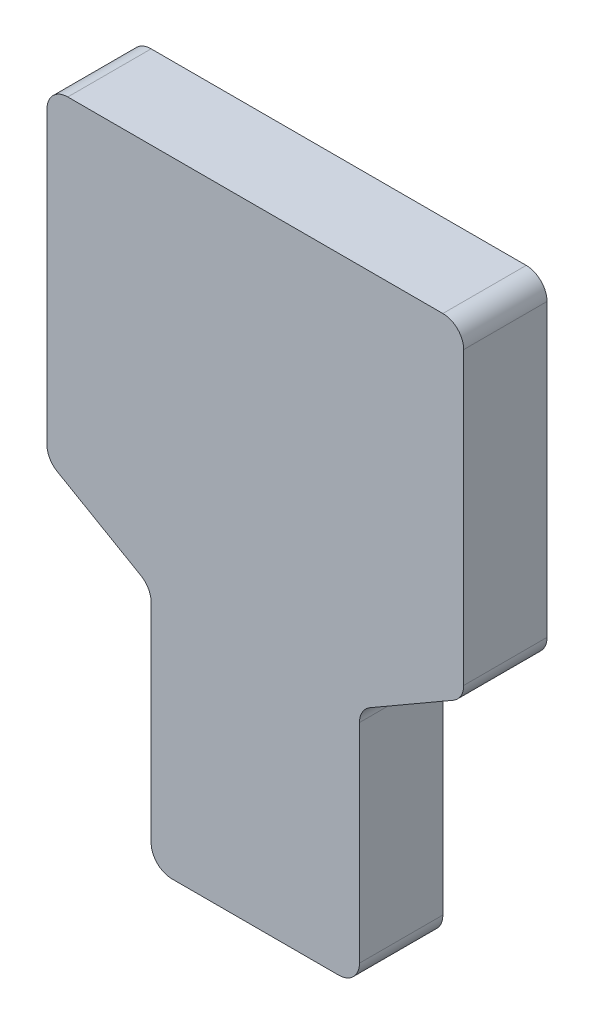
ISO-10303-21;
HEADER;
FILE_DESCRIPTION(('STEP AP214'),'2;1');
FILE_NAME('part.step','',(''),(''),'','','');
FILE_SCHEMA(('AUTOMOTIVE_DESIGN { 1 0 10303 214 1 1 1 1 }'));
ENDSEC;
DATA;
#1=APPLICATION_CONTEXT('core data for automotive mechanical design processes');
#2=APPLICATION_PROTOCOL_DEFINITION('international standard','automotive_design',2000,#1);
#3=PRODUCT_CONTEXT('',#1,'mechanical');
#4=PRODUCT('Part','Part','',(#3));
#5=PRODUCT_RELATED_PRODUCT_CATEGORY('part','',(#4));
#6=PRODUCT_DEFINITION_FORMATION('','',#4);
#7=PRODUCT_DEFINITION_CONTEXT('part definition',#1,'design');
#8=PRODUCT_DEFINITION('design','',#6,#7);
#9=PRODUCT_DEFINITION_SHAPE('','',#8);
#10=(LENGTH_UNIT() NAMED_UNIT(*) SI_UNIT(.MILLI.,.METRE.));
#11=(NAMED_UNIT(*) PLANE_ANGLE_UNIT() SI_UNIT($,.RADIAN.));
#12=(NAMED_UNIT(*) SI_UNIT($,.STERADIAN.) SOLID_ANGLE_UNIT());
#13=UNCERTAINTY_MEASURE_WITH_UNIT(LENGTH_MEASURE(1.E-05),#10,'distance_accuracy_value','');
#14=(GEOMETRIC_REPRESENTATION_CONTEXT(3) GLOBAL_UNCERTAINTY_ASSIGNED_CONTEXT((#13)) GLOBAL_UNIT_ASSIGNED_CONTEXT((#10,
#11,#12)) REPRESENTATION_CONTEXT('',''));
#15=CARTESIAN_POINT('',(0.,0.,0.));
#16=DIRECTION('',(0.,0.,1.));
#17=DIRECTION('',(1.,0.,0.));
#18=AXIS2_PLACEMENT_3D('',#15,#16,#17);
#19=CARTESIAN_POINT('',(-90.,290.,20.));
#20=DIRECTION('',(0.,0.,-1.));
#21=DIRECTION('',(-1.,0.,0.));
#22=AXIS2_PLACEMENT_3D('',#19,#20,#21);
#23=CYLINDRICAL_SURFACE('',#22,10.);
#24=CARTESIAN_POINT('',(-90.,290.,-20.));
#25=DIRECTION('',(0.,0.,1.));
#26=DIRECTION('',(-1.,0.,0.));
#27=AXIS2_PLACEMENT_3D('',#24,#25,#26);
#28=CIRCLE('',#27,10.);
#29=CARTESIAN_POINT('',(-90.,300.,-20.));
#30=VERTEX_POINT('',#29);
#31=CARTESIAN_POINT('',(-100.,290.,-20.));
#32=VERTEX_POINT('',#31);
#33=EDGE_CURVE('E176',#30,#32,#28,.T.);
#34=ORIENTED_EDGE('',*,*,#33,.T.);
#35=DIRECTION('',(0.,0.,-1.));
#36=VECTOR('',#35,1.);
#37=CARTESIAN_POINT('',(-100.,290.,20.));
#38=LINE('',#37,#36);
#39=CARTESIAN_POINT('',(-100.,290.,20.));
#40=VERTEX_POINT('',#39);
#41=EDGE_CURVE('E11',#40,#32,#38,.T.);
#42=ORIENTED_EDGE('',*,*,#41,.F.);
#43=CARTESIAN_POINT('',(-90.,290.,20.));
#44=DIRECTION('',(0.,0.,1.));
#45=DIRECTION('',(-1.,0.,0.));
#46=AXIS2_PLACEMENT_3D('',#43,#44,#45);
#47=CIRCLE('',#46,10.);
#48=CARTESIAN_POINT('',(-90.,300.,20.));
#49=VERTEX_POINT('',#48);
#50=EDGE_CURVE('E206',#49,#40,#47,.T.);
#51=ORIENTED_EDGE('',*,*,#50,.F.);
#52=DIRECTION('',(0.,0.,-1.));
#53=VECTOR('',#52,1.);
#54=CARTESIAN_POINT('',(-90.,300.,20.));
#55=LINE('',#54,#53);
#56=EDGE_CURVE('E172',#49,#30,#55,.T.);
#57=ORIENTED_EDGE('',*,*,#56,.T.);
#58=EDGE_LOOP('',(#34,#42,#51,#57));
#59=FACE_BOUND('',#58,.T.);
#60=ADVANCED_FACE('F32',(#59),#23,.T.);
#61=CARTESIAN_POINT('',(-100.,150.414518843274,20.));
#62=DIRECTION('',(1.,0.,0.));
#63=DIRECTION('',(0.,1.,0.));
#64=AXIS2_PLACEMENT_3D('',#61,#62,#63);
#65=PLANE('',#64);
#66=DIRECTION('',(0.,-1.,0.));
#67=VECTOR('',#66,1.);
#68=CARTESIAN_POINT('',(-100.,150.414518843274,-20.));
#69=LINE('',#68,#67);
#70=CARTESIAN_POINT('',(-100.,150.414518843274,-20.));
#71=VERTEX_POINT('',#70);
#72=EDGE_CURVE('E179',#32,#71,#69,.T.);
#73=ORIENTED_EDGE('',*,*,#72,.T.);
#74=DIRECTION('',(0.,0.,-1.));
#75=VECTOR('',#74,1.);
#76=CARTESIAN_POINT('',(-100.,150.414518843274,20.));
#77=LINE('',#76,#75);
#78=CARTESIAN_POINT('',(-100.,150.414518843274,20.));
#79=VERTEX_POINT('',#78);
#80=EDGE_CURVE('E40',#79,#71,#77,.T.);
#81=ORIENTED_EDGE('',*,*,#80,.F.);
#82=DIRECTION('',(0.,-1.,0.));
#83=VECTOR('',#82,1.);
#84=CARTESIAN_POINT('',(-100.,150.414518843274,20.));
#85=LINE('',#84,#83);
#86=EDGE_CURVE('E115',#40,#79,#85,.T.);
#87=ORIENTED_EDGE('',*,*,#86,.F.);
#88=ORIENTED_EDGE('',*,*,#41,.T.);
#89=EDGE_LOOP('',(#73,#81,#87,#88));
#90=FACE_BOUND('',#89,.T.);
#91=ADVANCED_FACE('F304',(#90),#65,.F.);
#92=CARTESIAN_POINT('',(-90.,150.414518843274,20.));
#93=DIRECTION('',(0.,0.,-1.));
#94=DIRECTION('',(-1.,0.,0.));
#95=AXIS2_PLACEMENT_3D('',#92,#93,#94);
#96=CYLINDRICAL_SURFACE('',#95,10.);
#97=CARTESIAN_POINT('',(-90.,150.414518843274,-20.));
#98=DIRECTION('',(0.,0.,1.));
#99=DIRECTION('',(-1.,0.,0.));
#100=AXIS2_PLACEMENT_3D('',#97,#98,#99);
#101=CIRCLE('',#100,10.);
#102=CARTESIAN_POINT('',(-95.,141.754264805429,-20.));
#103=VERTEX_POINT('',#102);
#104=EDGE_CURVE('E181',#71,#103,#101,.T.);
#105=ORIENTED_EDGE('',*,*,#104,.T.);
#106=DIRECTION('',(0.,0.,-1.));
#107=VECTOR('',#106,1.);
#108=CARTESIAN_POINT('',(-95.,141.754264805429,20.));
#109=LINE('',#108,#107);
#110=CARTESIAN_POINT('',(-95.,141.754264805429,20.));
#111=VERTEX_POINT('',#110);
#112=EDGE_CURVE('E237',#111,#103,#109,.T.);
#113=ORIENTED_EDGE('',*,*,#112,.F.);
#114=CARTESIAN_POINT('',(-90.,150.414518843274,20.));
#115=DIRECTION('',(0.,0.,1.));
#116=DIRECTION('',(-1.,0.,0.));
#117=AXIS2_PLACEMENT_3D('',#114,#115,#116);
#118=CIRCLE('',#117,10.);
#119=EDGE_CURVE('E245',#79,#111,#118,.T.);
#120=ORIENTED_EDGE('',*,*,#119,.F.);
#121=ORIENTED_EDGE('',*,*,#80,.T.);
#122=EDGE_LOOP('',(#105,#113,#120,#121));
#123=FACE_BOUND('',#122,.T.);
#124=ADVANCED_FACE('F243',(#123),#96,.T.);
#125=CARTESIAN_POINT('',(-55.,118.660254037844,20.));
#126=DIRECTION('',(0.499999999999997,0.86602540378444,0.));
#127=DIRECTION('',(-0.86602540378444,0.499999999999997,0.));
#128=AXIS2_PLACEMENT_3D('',#125,#126,#127);
#129=PLANE('',#128);
#130=DIRECTION('',(0.86602540378444,-0.499999999999997,0.));
#131=VECTOR('',#130,1.);
#132=CARTESIAN_POINT('',(-55.,118.660254037844,-20.));
#133=LINE('',#132,#131);
#134=CARTESIAN_POINT('',(-55.,118.660254037844,-20.));
#135=VERTEX_POINT('',#134);
#136=EDGE_CURVE('E183',#103,#135,#133,.T.);
#137=ORIENTED_EDGE('',*,*,#136,.T.);
#138=DIRECTION('',(0.,0.,-1.));
#139=VECTOR('',#138,1.);
#140=CARTESIAN_POINT('',(-55.,118.660254037844,20.));
#141=LINE('',#140,#139);
#142=CARTESIAN_POINT('',(-55.,118.660254037844,20.));
#143=VERTEX_POINT('',#142);
#144=EDGE_CURVE('E234',#143,#135,#141,.T.);
#145=ORIENTED_EDGE('',*,*,#144,.F.);
#146=DIRECTION('',(0.86602540378444,-0.499999999999997,0.));
#147=VECTOR('',#146,1.);
#148=CARTESIAN_POINT('',(-55.,118.660254037844,20.));
#149=LINE('',#148,#147);
#150=EDGE_CURVE('E263',#111,#143,#149,.T.);
#151=ORIENTED_EDGE('',*,*,#150,.F.);
#152=ORIENTED_EDGE('',*,*,#112,.T.);
#153=EDGE_LOOP('',(#137,#145,#151,#152));
#154=FACE_BOUND('',#153,.T.);
#155=ADVANCED_FACE('F254',(#154),#129,.F.);
#156=CARTESIAN_POINT('',(-60.,110.,20.));
#157=DIRECTION('',(0.,0.,-1.));
#158=DIRECTION('',(-1.,0.,0.));
#159=AXIS2_PLACEMENT_3D('',#156,#157,#158);
#160=CYLINDRICAL_SURFACE('',#159,10.);
#161=CARTESIAN_POINT('',(-60.,110.,-20.));
#162=DIRECTION('',(0.,0.,-1.));
#163=DIRECTION('',(1.,0.,0.));
#164=AXIS2_PLACEMENT_3D('',#161,#162,#163);
#165=CIRCLE('',#164,10.);
#166=CARTESIAN_POINT('',(-50.,110.,-20.));
#167=VERTEX_POINT('',#166);
#168=EDGE_CURVE('E185',#135,#167,#165,.T.);
#169=ORIENTED_EDGE('',*,*,#168,.T.);
#170=DIRECTION('',(0.,0.,-1.));
#171=VECTOR('',#170,1.);
#172=CARTESIAN_POINT('',(-50.,110.,20.));
#173=LINE('',#172,#171);
#174=CARTESIAN_POINT('',(-50.,110.,20.));
#175=VERTEX_POINT('',#174);
#176=EDGE_CURVE('E231',#175,#167,#173,.T.);
#177=ORIENTED_EDGE('',*,*,#176,.F.);
#178=CARTESIAN_POINT('',(-60.,110.,20.));
#179=DIRECTION('',(0.,0.,-1.));
#180=DIRECTION('',(1.,0.,0.));
#181=AXIS2_PLACEMENT_3D('',#178,#179,#180);
#182=CIRCLE('',#181,10.);
#183=EDGE_CURVE('E260',#143,#175,#182,.T.);
#184=ORIENTED_EDGE('',*,*,#183,.F.);
#185=ORIENTED_EDGE('',*,*,#144,.T.);
#186=EDGE_LOOP('',(#169,#177,#184,#185));
#187=FACE_BOUND('',#186,.T.);
#188=ADVANCED_FACE('F258',(#187),#160,.F.);
#189=CARTESIAN_POINT('',(-50.,10.,20.));
#190=DIRECTION('',(1.,0.,0.));
#191=DIRECTION('',(0.,0.,-1.));
#192=AXIS2_PLACEMENT_3D('',#189,#190,#191);
#193=PLANE('',#192);
#194=DIRECTION('',(0.,-1.,0.));
#195=VECTOR('',#194,1.);
#196=CARTESIAN_POINT('',(-50.,10.,-20.));
#197=LINE('',#196,#195);
#198=CARTESIAN_POINT('',(-50.,10.,-20.));
#199=VERTEX_POINT('',#198);
#200=EDGE_CURVE('E187',#167,#199,#197,.T.);
#201=ORIENTED_EDGE('',*,*,#200,.T.);
#202=DIRECTION('',(0.,0.,-1.));
#203=VECTOR('',#202,1.);
#204=CARTESIAN_POINT('',(-50.,10.,20.));
#205=LINE('',#204,#203);
#206=CARTESIAN_POINT('',(-50.,10.,20.));
#207=VERTEX_POINT('',#206);
#208=EDGE_CURVE('E228',#207,#199,#205,.T.);
#209=ORIENTED_EDGE('',*,*,#208,.F.);
#210=DIRECTION('',(0.,-1.,0.));
#211=VECTOR('',#210,1.);
#212=CARTESIAN_POINT('',(-50.,10.,20.));
#213=LINE('',#212,#211);
#214=EDGE_CURVE('E262',#175,#207,#213,.T.);
#215=ORIENTED_EDGE('',*,*,#214,.F.);
#216=ORIENTED_EDGE('',*,*,#176,.T.);
#217=EDGE_LOOP('',(#201,#209,#215,#216));
#218=FACE_BOUND('',#217,.T.);
#219=ADVANCED_FACE('F317',(#218),#193,.F.);
#220=CARTESIAN_POINT('',(-40.,10.,20.));
#221=DIRECTION('',(0.,0.,-1.));
#222=DIRECTION('',(-1.,0.,0.));
#223=AXIS2_PLACEMENT_3D('',#220,#221,#222);
#224=CYLINDRICAL_SURFACE('',#223,10.);
#225=CARTESIAN_POINT('',(-40.,10.,-20.));
#226=DIRECTION('',(0.,0.,1.));
#227=DIRECTION('',(-1.,0.,0.));
#228=AXIS2_PLACEMENT_3D('',#225,#226,#227);
#229=CIRCLE('',#228,10.);
#230=CARTESIAN_POINT('',(-40.,0.,-20.));
#231=VERTEX_POINT('',#230);
#232=EDGE_CURVE('E189',#199,#231,#229,.T.);
#233=ORIENTED_EDGE('',*,*,#232,.T.);
#234=DIRECTION('',(0.,0.,-1.));
#235=VECTOR('',#234,1.);
#236=CARTESIAN_POINT('',(-40.,0.,20.));
#237=LINE('',#236,#235);
#238=CARTESIAN_POINT('',(-40.,0.,20.));
#239=VERTEX_POINT('',#238);
#240=EDGE_CURVE('E225',#239,#231,#237,.T.);
#241=ORIENTED_EDGE('',*,*,#240,.F.);
#242=CARTESIAN_POINT('',(-40.,10.,20.));
#243=DIRECTION('',(0.,0.,1.));
#244=DIRECTION('',(-1.,0.,0.));
#245=AXIS2_PLACEMENT_3D('',#242,#243,#244);
#246=CIRCLE('',#245,10.);
#247=EDGE_CURVE('E265',#207,#239,#246,.T.);
#248=ORIENTED_EDGE('',*,*,#247,.F.);
#249=ORIENTED_EDGE('',*,*,#208,.T.);
#250=EDGE_LOOP('',(#233,#241,#248,#249));
#251=FACE_BOUND('',#250,.T.);
#252=ADVANCED_FACE('F320',(#251),#224,.T.);
#253=CARTESIAN_POINT('',(-40.,0.,20.));
#254=DIRECTION('',(0.,1.,0.));
#255=DIRECTION('',(-1.,0.,0.));
#256=AXIS2_PLACEMENT_3D('',#253,#254,#255);
#257=PLANE('',#256);
#258=DIRECTION('',(1.,0.,0.));
#259=VECTOR('',#258,1.);
#260=CARTESIAN_POINT('',(-40.,0.,-20.));
#261=LINE('',#260,#259);
#262=CARTESIAN_POINT('',(40.,0.,-20.));
#263=VERTEX_POINT('',#262);
#264=EDGE_CURVE('E191',#231,#263,#261,.T.);
#265=ORIENTED_EDGE('',*,*,#264,.T.);
#266=DIRECTION('',(0.,0.,-1.));
#267=VECTOR('',#266,1.);
#268=CARTESIAN_POINT('',(40.,0.,20.));
#269=LINE('',#268,#267);
#270=CARTESIAN_POINT('',(40.,0.,20.));
#271=VERTEX_POINT('',#270);
#272=EDGE_CURVE('E222',#271,#263,#269,.T.);
#273=ORIENTED_EDGE('',*,*,#272,.F.);
#274=DIRECTION('',(1.,0.,0.));
#275=VECTOR('',#274,1.);
#276=CARTESIAN_POINT('',(-40.,0.,20.));
#277=LINE('',#276,#275);
#278=EDGE_CURVE('E271',#239,#271,#277,.T.);
#279=ORIENTED_EDGE('',*,*,#278,.F.);
#280=ORIENTED_EDGE('',*,*,#240,.T.);
#281=EDGE_LOOP('',(#265,#273,#279,#280));
#282=FACE_BOUND('',#281,.T.);
#283=ADVANCED_FACE('F324',(#282),#257,.F.);
#284=CARTESIAN_POINT('',(40.,10.,20.));
#285=DIRECTION('',(0.,0.,-1.));
#286=DIRECTION('',(-1.,0.,0.));
#287=AXIS2_PLACEMENT_3D('',#284,#285,#286);
#288=CYLINDRICAL_SURFACE('',#287,10.);
#289=CARTESIAN_POINT('',(40.,10.,-20.));
#290=DIRECTION('',(0.,0.,1.));
#291=DIRECTION('',(1.,0.,0.));
#292=AXIS2_PLACEMENT_3D('',#289,#290,#291);
#293=CIRCLE('',#292,10.);
#294=CARTESIAN_POINT('',(50.,10.,-20.));
#295=VERTEX_POINT('',#294);
#296=EDGE_CURVE('E193',#263,#295,#293,.T.);
#297=ORIENTED_EDGE('',*,*,#296,.T.);
#298=DIRECTION('',(0.,0.,-1.));
#299=VECTOR('',#298,1.);
#300=CARTESIAN_POINT('',(50.,10.,20.));
#301=LINE('',#300,#299);
#302=CARTESIAN_POINT('',(50.,10.,20.));
#303=VERTEX_POINT('',#302);
#304=EDGE_CURVE('E219',#303,#295,#301,.T.);
#305=ORIENTED_EDGE('',*,*,#304,.F.);
#306=CARTESIAN_POINT('',(40.,10.,20.));
#307=DIRECTION('',(0.,0.,1.));
#308=DIRECTION('',(1.,0.,0.));
#309=AXIS2_PLACEMENT_3D('',#306,#307,#308);
#310=CIRCLE('',#309,10.);
#311=EDGE_CURVE('E273',#271,#303,#310,.T.);
#312=ORIENTED_EDGE('',*,*,#311,.F.);
#313=ORIENTED_EDGE('',*,*,#272,.T.);
#314=EDGE_LOOP('',(#297,#305,#312,#313));
#315=FACE_BOUND('',#314,.T.);
#316=ADVANCED_FACE('F328',(#315),#288,.T.);
#317=CARTESIAN_POINT('',(50.,10.,20.));
#318=DIRECTION('',(-1.,0.,0.));
#319=DIRECTION('',(0.,-1.,0.));
#320=AXIS2_PLACEMENT_3D('',#317,#318,#319);
#321=PLANE('',#320);
#322=DIRECTION('',(0.,1.,0.));
#323=VECTOR('',#322,1.);
#324=CARTESIAN_POINT('',(50.,10.,-20.));
#325=LINE('',#324,#323);
#326=CARTESIAN_POINT('',(50.,110.,-20.));
#327=VERTEX_POINT('',#326);
#328=EDGE_CURVE('E195',#295,#327,#325,.T.);
#329=ORIENTED_EDGE('',*,*,#328,.T.);
#330=DIRECTION('',(0.,0.,-1.));
#331=VECTOR('',#330,1.);
#332=CARTESIAN_POINT('',(50.,110.,20.));
#333=LINE('',#332,#331);
#334=CARTESIAN_POINT('',(50.,110.,20.));
#335=VERTEX_POINT('',#334);
#336=EDGE_CURVE('E216',#335,#327,#333,.T.);
#337=ORIENTED_EDGE('',*,*,#336,.F.);
#338=DIRECTION('',(0.,1.,0.));
#339=VECTOR('',#338,1.);
#340=CARTESIAN_POINT('',(50.,10.,20.));
#341=LINE('',#340,#339);
#342=EDGE_CURVE('E275',#303,#335,#341,.T.);
#343=ORIENTED_EDGE('',*,*,#342,.F.);
#344=ORIENTED_EDGE('',*,*,#304,.T.);
#345=EDGE_LOOP('',(#329,#337,#343,#344));
#346=FACE_BOUND('',#345,.T.);
#347=ADVANCED_FACE('F332',(#346),#321,.F.);
#348=CARTESIAN_POINT('',(60.,110.,20.));
#349=DIRECTION('',(0.,0.,-1.));
#350=DIRECTION('',(-1.,0.,0.));
#351=AXIS2_PLACEMENT_3D('',#348,#349,#350);
#352=CYLINDRICAL_SURFACE('',#351,10.);
#353=CARTESIAN_POINT('',(60.,110.,-20.));
#354=DIRECTION('',(0.,0.,-1.));
#355=DIRECTION('',(-1.,0.,0.));
#356=AXIS2_PLACEMENT_3D('',#353,#354,#355);
#357=CIRCLE('',#356,10.);
#358=CARTESIAN_POINT('',(55.,118.660254037844,-20.));
#359=VERTEX_POINT('',#358);
#360=EDGE_CURVE('E197',#327,#359,#357,.T.);
#361=ORIENTED_EDGE('',*,*,#360,.T.);
#362=DIRECTION('',(0.,0.,-1.));
#363=VECTOR('',#362,1.);
#364=CARTESIAN_POINT('',(55.,118.660254037844,20.));
#365=LINE('',#364,#363);
#366=CARTESIAN_POINT('',(55.,118.660254037844,20.));
#367=VERTEX_POINT('',#366);
#368=EDGE_CURVE('E213',#367,#359,#365,.T.);
#369=ORIENTED_EDGE('',*,*,#368,.F.);
#370=CARTESIAN_POINT('',(60.,110.,20.));
#371=DIRECTION('',(0.,0.,-1.));
#372=DIRECTION('',(-1.,0.,0.));
#373=AXIS2_PLACEMENT_3D('',#370,#371,#372);
#374=CIRCLE('',#373,10.);
#375=EDGE_CURVE('E277',#335,#367,#374,.T.);
#376=ORIENTED_EDGE('',*,*,#375,.F.);
#377=ORIENTED_EDGE('',*,*,#336,.T.);
#378=EDGE_LOOP('',(#361,#369,#376,#377));
#379=FACE_BOUND('',#378,.T.);
#380=ADVANCED_FACE('F336',(#379),#352,.F.);
#381=CARTESIAN_POINT('',(55.,118.660254037844,20.));
#382=DIRECTION('',(-0.499999999999999,0.866025403784439,0.));
#383=DIRECTION('',(-0.866025403784439,-0.499999999999999,0.));
#384=AXIS2_PLACEMENT_3D('',#381,#382,#383);
#385=PLANE('',#384);
#386=DIRECTION('',(0.866025403784439,0.499999999999999,0.));
#387=VECTOR('',#386,1.);
#388=CARTESIAN_POINT('',(55.,118.660254037844,-20.));
#389=LINE('',#388,#387);
#390=CARTESIAN_POINT('',(95.,141.754264805429,-20.));
#391=VERTEX_POINT('',#390);
#392=EDGE_CURVE('E199',#359,#391,#389,.T.);
#393=ORIENTED_EDGE('',*,*,#392,.T.);
#394=DIRECTION('',(0.,0.,-1.));
#395=VECTOR('',#394,1.);
#396=CARTESIAN_POINT('',(95.,141.754264805429,20.));
#397=LINE('',#396,#395);
#398=CARTESIAN_POINT('',(95.,141.754264805429,20.));
#399=VERTEX_POINT('',#398);
#400=EDGE_CURVE('E210',#399,#391,#397,.T.);
#401=ORIENTED_EDGE('',*,*,#400,.F.);
#402=DIRECTION('',(0.866025403784439,0.499999999999999,0.));
#403=VECTOR('',#402,1.);
#404=CARTESIAN_POINT('',(55.,118.660254037844,20.));
#405=LINE('',#404,#403);
#406=EDGE_CURVE('E279',#367,#399,#405,.T.);
#407=ORIENTED_EDGE('',*,*,#406,.F.);
#408=ORIENTED_EDGE('',*,*,#368,.T.);
#409=EDGE_LOOP('',(#393,#401,#407,#408));
#410=FACE_BOUND('',#409,.T.);
#411=ADVANCED_FACE('F285',(#410),#385,.F.);
#412=CARTESIAN_POINT('',(90.,150.414518843274,20.));
#413=DIRECTION('',(0.,0.,-1.));
#414=DIRECTION('',(-1.,0.,0.));
#415=AXIS2_PLACEMENT_3D('',#412,#413,#414);
#416=CYLINDRICAL_SURFACE('',#415,9.99999999999999);
#417=CARTESIAN_POINT('',(90.,150.414518843274,-20.));
#418=DIRECTION('',(0.,0.,1.));
#419=DIRECTION('',(1.,0.,0.));
#420=AXIS2_PLACEMENT_3D('',#417,#418,#419);
#421=CIRCLE('',#420,9.99999999999999);
#422=CARTESIAN_POINT('',(100.,150.414518843274,-20.));
#423=VERTEX_POINT('',#422);
#424=EDGE_CURVE('E201',#391,#423,#421,.T.);
#425=ORIENTED_EDGE('',*,*,#424,.T.);
#426=DIRECTION('',(0.,0.,-1.));
#427=VECTOR('',#426,1.);
#428=CARTESIAN_POINT('',(100.,150.414518843274,20.));
#429=LINE('',#428,#427);
#430=CARTESIAN_POINT('',(100.,150.414518843274,20.));
#431=VERTEX_POINT('',#430);
#432=EDGE_CURVE('E167',#431,#423,#429,.T.);
#433=ORIENTED_EDGE('',*,*,#432,.F.);
#434=CARTESIAN_POINT('',(90.,150.414518843274,20.));
#435=DIRECTION('',(0.,0.,1.));
#436=DIRECTION('',(1.,0.,0.));
#437=AXIS2_PLACEMENT_3D('',#434,#435,#436);
#438=CIRCLE('',#437,9.99999999999999);
#439=EDGE_CURVE('E158',#399,#431,#438,.T.);
#440=ORIENTED_EDGE('',*,*,#439,.F.);
#441=ORIENTED_EDGE('',*,*,#400,.T.);
#442=EDGE_LOOP('',(#425,#433,#440,#441));
#443=FACE_BOUND('',#442,.T.);
#444=ADVANCED_FACE('F289',(#443),#416,.T.);
#445=CARTESIAN_POINT('',(100.,150.414518843274,20.));
#446=DIRECTION('',(-1.,0.,0.));
#447=DIRECTION('',(0.,-1.,0.));
#448=AXIS2_PLACEMENT_3D('',#445,#446,#447);
#449=PLANE('',#448);
#450=DIRECTION('',(0.,1.,0.));
#451=VECTOR('',#450,1.);
#452=CARTESIAN_POINT('',(100.,150.414518843274,-20.));
#453=LINE('',#452,#451);
#454=CARTESIAN_POINT('',(100.,290.,-20.));
#455=VERTEX_POINT('',#454);
#456=EDGE_CURVE('E166',#423,#455,#453,.T.);
#457=ORIENTED_EDGE('',*,*,#456,.T.);
#458=DIRECTION('',(0.,0.,-1.));
#459=VECTOR('',#458,1.);
#460=CARTESIAN_POINT('',(100.,290.,20.));
#461=LINE('',#460,#459);
#462=CARTESIAN_POINT('',(100.,290.,20.));
#463=VERTEX_POINT('',#462);
#464=EDGE_CURVE('E163',#463,#455,#461,.T.);
#465=ORIENTED_EDGE('',*,*,#464,.F.);
#466=DIRECTION('',(0.,1.,0.));
#467=VECTOR('',#466,1.);
#468=CARTESIAN_POINT('',(100.,150.414518843274,20.));
#469=LINE('',#468,#467);
#470=EDGE_CURVE('E152',#431,#463,#469,.T.);
#471=ORIENTED_EDGE('',*,*,#470,.F.);
#472=ORIENTED_EDGE('',*,*,#432,.T.);
#473=EDGE_LOOP('',(#457,#465,#471,#472));
#474=FACE_BOUND('',#473,.T.);
#475=ADVANCED_FACE('F164',(#474),#449,.F.);
#476=CARTESIAN_POINT('',(90.,290.,20.));
#477=DIRECTION('',(0.,0.,-1.));
#478=DIRECTION('',(-1.,0.,0.));
#479=AXIS2_PLACEMENT_3D('',#476,#477,#478);
#480=CYLINDRICAL_SURFACE('',#479,10.);
#481=CARTESIAN_POINT('',(90.,290.,-20.));
#482=DIRECTION('',(0.,0.,1.));
#483=DIRECTION('',(1.,0.,0.));
#484=AXIS2_PLACEMENT_3D('',#481,#482,#483);
#485=CIRCLE('',#484,10.);
#486=CARTESIAN_POINT('',(90.,300.,-20.));
#487=VERTEX_POINT('',#486);
#488=EDGE_CURVE('E101',#455,#487,#485,.T.);
#489=ORIENTED_EDGE('',*,*,#488,.T.);
#490=DIRECTION('',(0.,0.,-1.));
#491=VECTOR('',#490,1.);
#492=CARTESIAN_POINT('',(90.,300.,20.));
#493=LINE('',#492,#491);
#494=CARTESIAN_POINT('',(90.,300.,20.));
#495=VERTEX_POINT('',#494);
#496=EDGE_CURVE('E168',#495,#487,#493,.T.);
#497=ORIENTED_EDGE('',*,*,#496,.F.);
#498=CARTESIAN_POINT('',(90.,290.,20.));
#499=DIRECTION('',(0.,0.,1.));
#500=DIRECTION('',(1.,0.,0.));
#501=AXIS2_PLACEMENT_3D('',#498,#499,#500);
#502=CIRCLE('',#501,10.);
#503=EDGE_CURVE('E156',#463,#495,#502,.T.);
#504=ORIENTED_EDGE('',*,*,#503,.F.);
#505=ORIENTED_EDGE('',*,*,#464,.T.);
#506=EDGE_LOOP('',(#489,#497,#504,#505));
#507=FACE_BOUND('',#506,.T.);
#508=ADVANCED_FACE('F170',(#507),#480,.T.);
#509=CARTESIAN_POINT('',(-90.,300.,20.));
#510=DIRECTION('',(0.,-1.,0.));
#511=DIRECTION('',(0.,0.,-1.));
#512=AXIS2_PLACEMENT_3D('',#509,#510,#511);
#513=PLANE('',#512);
#514=DIRECTION('',(-1.,0.,0.));
#515=VECTOR('',#514,1.);
#516=CARTESIAN_POINT('',(-90.,300.,-20.));
#517=LINE('',#516,#515);
#518=EDGE_CURVE('E107',#487,#30,#517,.T.);
#519=ORIENTED_EDGE('',*,*,#518,.T.);
#520=ORIENTED_EDGE('',*,*,#56,.F.);
#521=DIRECTION('',(-1.,0.,0.));
#522=VECTOR('',#521,1.);
#523=CARTESIAN_POINT('',(-90.,300.,20.));
#524=LINE('',#523,#522);
#525=EDGE_CURVE('E48',#495,#49,#524,.T.);
#526=ORIENTED_EDGE('',*,*,#525,.F.);
#527=ORIENTED_EDGE('',*,*,#496,.T.);
#528=EDGE_LOOP('',(#519,#520,#526,#527));
#529=FACE_BOUND('',#528,.T.);
#530=ADVANCED_FACE('F293',(#529),#513,.F.);
#531=CARTESIAN_POINT('',(-90.,290.,20.));
#532=DIRECTION('',(0.,0.,-1.));
#533=DIRECTION('',(-1.,0.,0.));
#534=AXIS2_PLACEMENT_3D('',#531,#532,#533);
#535=PLANE('',#534);
#536=ORIENTED_EDGE('',*,*,#50,.T.);
#537=ORIENTED_EDGE('',*,*,#86,.T.);
#538=ORIENTED_EDGE('',*,*,#119,.T.);
#539=ORIENTED_EDGE('',*,*,#150,.T.);
#540=ORIENTED_EDGE('',*,*,#183,.T.);
#541=ORIENTED_EDGE('',*,*,#214,.T.);
#542=ORIENTED_EDGE('',*,*,#247,.T.);
#543=ORIENTED_EDGE('',*,*,#278,.T.);
#544=ORIENTED_EDGE('',*,*,#311,.T.);
#545=ORIENTED_EDGE('',*,*,#342,.T.);
#546=ORIENTED_EDGE('',*,*,#375,.T.);
#547=ORIENTED_EDGE('',*,*,#406,.T.);
#548=ORIENTED_EDGE('',*,*,#439,.T.);
#549=ORIENTED_EDGE('',*,*,#470,.T.);
#550=ORIENTED_EDGE('',*,*,#503,.T.);
#551=ORIENTED_EDGE('',*,*,#525,.T.);
#552=EDGE_LOOP('',(#536,#537,#538,#539,#540,#541,#542,#543,#544,#545,#546,#547,#548,#549,#550,#551));
#553=FACE_BOUND('',#552,.T.);
#554=ADVANCED_FACE('F154',(#553),#535,.F.);
#555=CARTESIAN_POINT('',(-90.,290.,-20.));
#556=DIRECTION('',(0.,0.,-1.));
#557=DIRECTION('',(-1.,0.,0.));
#558=AXIS2_PLACEMENT_3D('',#555,#556,#557);
#559=PLANE('',#558);
#560=ORIENTED_EDGE('',*,*,#33,.F.);
#561=ORIENTED_EDGE('',*,*,#518,.F.);
#562=ORIENTED_EDGE('',*,*,#488,.F.);
#563=ORIENTED_EDGE('',*,*,#456,.F.);
#564=ORIENTED_EDGE('',*,*,#424,.F.);
#565=ORIENTED_EDGE('',*,*,#392,.F.);
#566=ORIENTED_EDGE('',*,*,#360,.F.);
#567=ORIENTED_EDGE('',*,*,#328,.F.);
#568=ORIENTED_EDGE('',*,*,#296,.F.);
#569=ORIENTED_EDGE('',*,*,#264,.F.);
#570=ORIENTED_EDGE('',*,*,#232,.F.);
#571=ORIENTED_EDGE('',*,*,#200,.F.);
#572=ORIENTED_EDGE('',*,*,#168,.F.);
#573=ORIENTED_EDGE('',*,*,#136,.F.);
#574=ORIENTED_EDGE('',*,*,#104,.F.);
#575=ORIENTED_EDGE('',*,*,#72,.F.);
#576=EDGE_LOOP('',(#560,#561,#562,#563,#564,#565,#566,#567,#568,#569,#570,#571,#572,#573,#574,#575));
#577=FACE_BOUND('',#576,.T.);
#578=ADVANCED_FACE('F249',(#577),#559,.T.);
#579=CLOSED_SHELL('',(#60,#91,#124,#155,#188,#219,#252,#283,#316,#347,#380,#411,#444,#475,#508,
#530,#554,#578));
#580=MANIFOLD_SOLID_BREP('B2',#579);
#581=ADVANCED_BREP_SHAPE_REPRESENTATION('',(#18,#580),#14);
#582=SHAPE_DEFINITION_REPRESENTATION(#9,#581);
ENDSEC;
END-ISO-10303-21;
